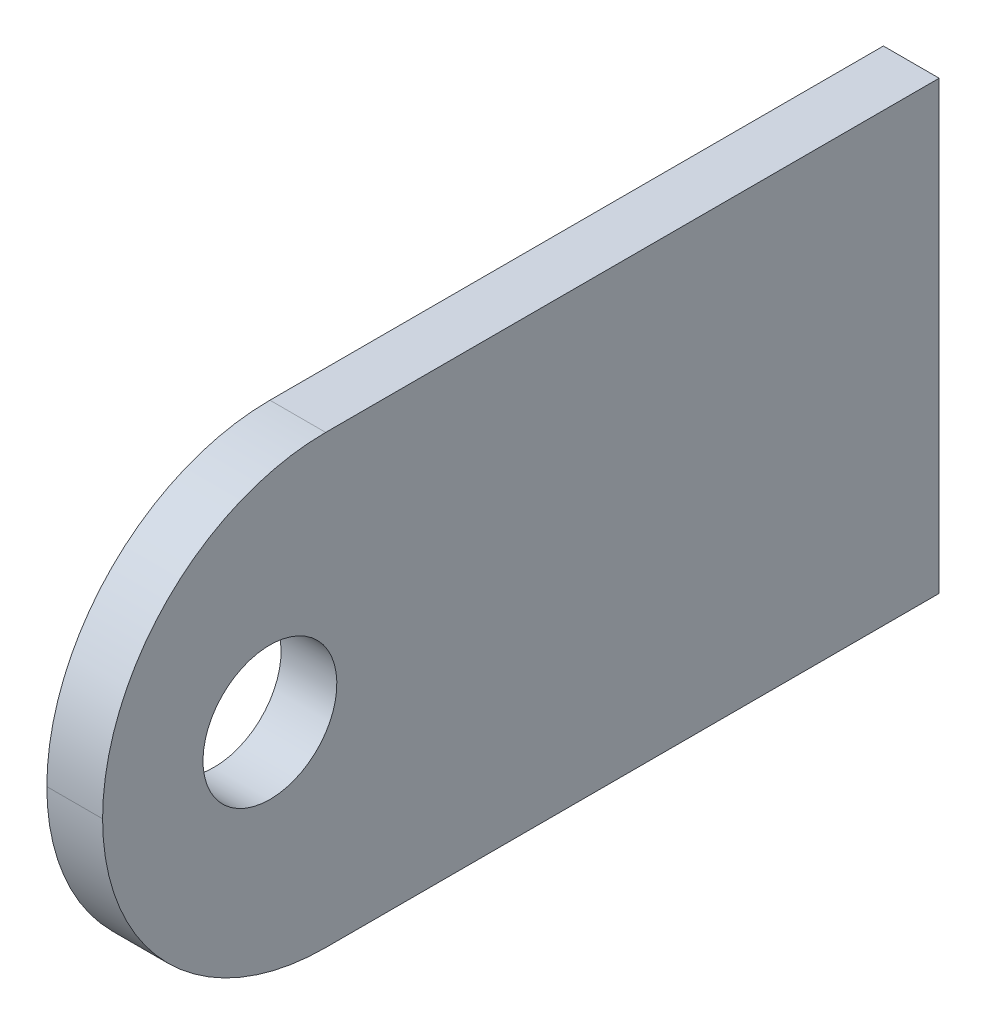
ISO-10303-21;
HEADER;
FILE_DESCRIPTION(('STEP AP214'),'2;1');
FILE_NAME('part.step','',(''),(''),'','','');
FILE_SCHEMA(('AUTOMOTIVE_DESIGN { 1 0 10303 214 1 1 1 1 }'));
ENDSEC;
DATA;
#1=APPLICATION_CONTEXT('core data for automotive mechanical design processes');
#2=APPLICATION_PROTOCOL_DEFINITION('international standard','automotive_design',2000,#1);
#3=PRODUCT_CONTEXT('',#1,'mechanical');
#4=PRODUCT('Part','Part','',(#3));
#5=PRODUCT_RELATED_PRODUCT_CATEGORY('part','',(#4));
#6=PRODUCT_DEFINITION_FORMATION('','',#4);
#7=PRODUCT_DEFINITION_CONTEXT('part definition',#1,'design');
#8=PRODUCT_DEFINITION('design','',#6,#7);
#9=PRODUCT_DEFINITION_SHAPE('','',#8);
#10=(LENGTH_UNIT() NAMED_UNIT(*) SI_UNIT(.MILLI.,.METRE.));
#11=(NAMED_UNIT(*) PLANE_ANGLE_UNIT() SI_UNIT($,.RADIAN.));
#12=(NAMED_UNIT(*) SI_UNIT($,.STERADIAN.) SOLID_ANGLE_UNIT());
#13=UNCERTAINTY_MEASURE_WITH_UNIT(LENGTH_MEASURE(1.E-05),#10,'distance_accuracy_value','');
#14=(GEOMETRIC_REPRESENTATION_CONTEXT(3) GLOBAL_UNCERTAINTY_ASSIGNED_CONTEXT((#13)) GLOBAL_UNIT_ASSIGNED_CONTEXT((#10,
#11,#12)) REPRESENTATION_CONTEXT('',''));
#15=CARTESIAN_POINT('',(0.,0.,0.));
#16=DIRECTION('',(0.,0.,1.));
#17=DIRECTION('',(1.,0.,0.));
#18=AXIS2_PLACEMENT_3D('',#15,#16,#17);
#19=CARTESIAN_POINT('',(-160.,0.,75.));
#20=DIRECTION('',(0.,-1.,0.));
#21=DIRECTION('',(1.,0.,0.));
#22=AXIS2_PLACEMENT_3D('',#19,#20,#21);
#23=PLANE('',#22);
#24=DIRECTION('',(0.,0.,-1.));
#25=VECTOR('',#24,1.);
#26=CARTESIAN_POINT('',(-160.,0.,75.));
#27=LINE('',#26,#25);
#28=CARTESIAN_POINT('',(-160.,0.,55.));
#29=VERTEX_POINT('',#28);
#30=CARTESIAN_POINT('',(-160.,0.,0.));
#31=VERTEX_POINT('',#30);
#32=EDGE_CURVE('E78',#29,#31,#27,.T.);
#33=ORIENTED_EDGE('',*,*,#32,.F.);
#34=DIRECTION('',(-1.,0.,0.));
#35=VECTOR('',#34,1.);
#36=CARTESIAN_POINT('',(-160.,0.,55.));
#37=LINE('',#36,#35);
#38=CARTESIAN_POINT('',(-155.,0.,55.));
#39=VERTEX_POINT('',#38);
#40=EDGE_CURVE('E119',#29,#39,#37,.F.);
#41=ORIENTED_EDGE('',*,*,#40,.T.);
#42=DIRECTION('',(0.,0.,-1.));
#43=VECTOR('',#42,1.);
#44=CARTESIAN_POINT('',(-155.,0.,75.));
#45=LINE('',#44,#43);
#46=CARTESIAN_POINT('',(-155.,0.,0.));
#47=VERTEX_POINT('',#46);
#48=EDGE_CURVE('E101',#39,#47,#45,.T.);
#49=ORIENTED_EDGE('',*,*,#48,.T.);
#50=DIRECTION('',(-1.,0.,0.));
#51=VECTOR('',#50,1.);
#52=CARTESIAN_POINT('',(-160.,0.,0.));
#53=LINE('',#52,#51);
#54=EDGE_CURVE('E97',#47,#31,#53,.T.);
#55=ORIENTED_EDGE('',*,*,#54,.T.);
#56=EDGE_LOOP('',(#33,#41,#49,#55));
#57=FACE_BOUND('',#56,.T.);
#58=ADVANCED_FACE('F34',(#57),#23,.F.);
#59=CARTESIAN_POINT('',(-160.,0.,75.));
#60=DIRECTION('',(1.,0.,0.));
#61=DIRECTION('',(0.,1.,0.));
#62=AXIS2_PLACEMENT_3D('',#59,#60,#61);
#63=PLANE('',#62);
#64=CARTESIAN_POINT('',(-160.,-20.,60.));
#65=DIRECTION('',(-1.,0.,0.));
#66=DIRECTION('',(0.,-1.,0.));
#67=AXIS2_PLACEMENT_3D('',#64,#65,#66);
#68=CIRCLE('',#67,6.);
#69=CARTESIAN_POINT('',(-160.,-26.,60.));
#70=VERTEX_POINT('',#69);
#71=EDGE_CURVE('E106',#70,#70,#68,.T.);
#72=ORIENTED_EDGE('',*,*,#71,.F.);
#73=EDGE_LOOP('',(#72));
#74=FACE_BOUND('',#73,.T.);
#75=CARTESIAN_POINT('',(-160.,-20.,55.));
#76=DIRECTION('',(1.,0.,0.));
#77=DIRECTION('',(0.,1.,0.));
#78=AXIS2_PLACEMENT_3D('',#75,#76,#77);
#79=CIRCLE('',#78,20.);
#80=CARTESIAN_POINT('',(-160.,-40.,55.));
#81=VERTEX_POINT('',#80);
#82=CARTESIAN_POINT('',(-160.,-20.,75.));
#83=VERTEX_POINT('',#82);
#84=EDGE_CURVE('E90',#81,#83,#79,.F.);
#85=ORIENTED_EDGE('',*,*,#84,.T.);
#86=CARTESIAN_POINT('',(-160.,-20.,55.));
#87=DIRECTION('',(1.,0.,0.));
#88=DIRECTION('',(0.,1.,0.));
#89=AXIS2_PLACEMENT_3D('',#86,#87,#88);
#90=CIRCLE('',#89,20.);
#91=EDGE_CURVE('E85',#83,#29,#90,.F.);
#92=ORIENTED_EDGE('',*,*,#91,.T.);
#93=ORIENTED_EDGE('',*,*,#32,.T.);
#94=DIRECTION('',(0.,-1.,0.));
#95=VECTOR('',#94,1.);
#96=CARTESIAN_POINT('',(-160.,0.,0.));
#97=LINE('',#96,#95);
#98=CARTESIAN_POINT('',(-160.,-40.,0.));
#99=VERTEX_POINT('',#98);
#100=EDGE_CURVE('E82',#31,#99,#97,.T.);
#101=ORIENTED_EDGE('',*,*,#100,.T.);
#102=DIRECTION('',(0.,0.,-1.));
#103=VECTOR('',#102,1.);
#104=CARTESIAN_POINT('',(-160.,-40.,75.));
#105=LINE('',#104,#103);
#106=EDGE_CURVE('E91',#81,#99,#105,.T.);
#107=ORIENTED_EDGE('',*,*,#106,.F.);
#108=EDGE_LOOP('',(#85,#92,#93,#101,#107));
#109=FACE_BOUND('',#108,.T.);
#110=ADVANCED_FACE('F80',(#74,#109),#63,.F.);
#111=CARTESIAN_POINT('',(-155.,-40.,75.));
#112=DIRECTION('',(0.,1.,0.));
#113=DIRECTION('',(-1.,0.,0.));
#114=AXIS2_PLACEMENT_3D('',#111,#112,#113);
#115=PLANE('',#114);
#116=DIRECTION('',(0.,0.,-1.));
#117=VECTOR('',#116,1.);
#118=CARTESIAN_POINT('',(-155.,-40.,75.));
#119=LINE('',#118,#117);
#120=CARTESIAN_POINT('',(-155.,-40.,55.));
#121=VERTEX_POINT('',#120);
#122=CARTESIAN_POINT('',(-155.,-40.,0.));
#123=VERTEX_POINT('',#122);
#124=EDGE_CURVE('E114',#121,#123,#119,.T.);
#125=ORIENTED_EDGE('',*,*,#124,.F.);
#126=DIRECTION('',(1.,0.,0.));
#127=VECTOR('',#126,1.);
#128=CARTESIAN_POINT('',(-155.,-40.,55.));
#129=LINE('',#128,#127);
#130=EDGE_CURVE('E11',#121,#81,#129,.F.);
#131=ORIENTED_EDGE('',*,*,#130,.T.);
#132=ORIENTED_EDGE('',*,*,#106,.T.);
#133=DIRECTION('',(1.,0.,0.));
#134=VECTOR('',#133,1.);
#135=CARTESIAN_POINT('',(-155.,-40.,0.));
#136=LINE('',#135,#134);
#137=EDGE_CURVE('E99',#99,#123,#136,.T.);
#138=ORIENTED_EDGE('',*,*,#137,.T.);
#139=EDGE_LOOP('',(#125,#131,#132,#138));
#140=FACE_BOUND('',#139,.T.);
#141=ADVANCED_FACE('F126',(#140),#115,.F.);
#142=CARTESIAN_POINT('',(-155.,0.,75.));
#143=DIRECTION('',(-1.,0.,0.));
#144=DIRECTION('',(0.,-1.,0.));
#145=AXIS2_PLACEMENT_3D('',#142,#143,#144);
#146=PLANE('',#145);
#147=CARTESIAN_POINT('',(-155.,-20.,60.));
#148=DIRECTION('',(-1.,0.,0.));
#149=DIRECTION('',(0.,-1.,0.));
#150=AXIS2_PLACEMENT_3D('',#147,#148,#149);
#151=CIRCLE('',#150,6.);
#152=CARTESIAN_POINT('',(-155.,-26.,60.));
#153=VERTEX_POINT('',#152);
#154=EDGE_CURVE('E103',#153,#153,#151,.T.);
#155=ORIENTED_EDGE('',*,*,#154,.T.);
#156=EDGE_LOOP('',(#155));
#157=FACE_BOUND('',#156,.T.);
#158=ORIENTED_EDGE('',*,*,#48,.F.);
#159=CARTESIAN_POINT('',(-155.,-20.,55.));
#160=DIRECTION('',(-1.,0.,0.));
#161=DIRECTION('',(0.,-1.,0.));
#162=AXIS2_PLACEMENT_3D('',#159,#160,#161);
#163=CIRCLE('',#162,20.);
#164=CARTESIAN_POINT('',(-155.,-20.,75.));
#165=VERTEX_POINT('',#164);
#166=EDGE_CURVE('E43',#39,#165,#163,.F.);
#167=ORIENTED_EDGE('',*,*,#166,.T.);
#168=CARTESIAN_POINT('',(-155.,-20.,55.));
#169=DIRECTION('',(-1.,0.,0.));
#170=DIRECTION('',(0.,-1.,0.));
#171=AXIS2_PLACEMENT_3D('',#168,#169,#170);
#172=CIRCLE('',#171,20.);
#173=EDGE_CURVE('E50',#165,#121,#172,.F.);
#174=ORIENTED_EDGE('',*,*,#173,.T.);
#175=ORIENTED_EDGE('',*,*,#124,.T.);
#176=DIRECTION('',(0.,1.,0.));
#177=VECTOR('',#176,1.);
#178=CARTESIAN_POINT('',(-155.,0.,0.));
#179=LINE('',#178,#177);
#180=EDGE_CURVE('E111',#123,#47,#179,.T.);
#181=ORIENTED_EDGE('',*,*,#180,.T.);
#182=EDGE_LOOP('',(#158,#167,#174,#175,#181));
#183=FACE_BOUND('',#182,.T.);
#184=ADVANCED_FACE('F123',(#157,#183),#146,.F.);
#185=CARTESIAN_POINT('',(-2.5,0.,0.));
#186=DIRECTION('',(0.,0.,-1.));
#187=DIRECTION('',(-1.,0.,0.));
#188=AXIS2_PLACEMENT_3D('',#185,#186,#187);
#189=PLANE('',#188);
#190=ORIENTED_EDGE('',*,*,#54,.F.);
#191=ORIENTED_EDGE('',*,*,#180,.F.);
#192=ORIENTED_EDGE('',*,*,#137,.F.);
#193=ORIENTED_EDGE('',*,*,#100,.F.);
#194=EDGE_LOOP('',(#190,#191,#192,#193));
#195=FACE_BOUND('',#194,.T.);
#196=ADVANCED_FACE('F95',(#195),#189,.T.);
#197=CARTESIAN_POINT('',(-150.,-20.,60.));
#198=DIRECTION('',(-1.,0.,0.));
#199=DIRECTION('',(0.,-1.,0.));
#200=AXIS2_PLACEMENT_3D('',#197,#198,#199);
#201=CYLINDRICAL_SURFACE('',#200,6.);
#202=ORIENTED_EDGE('',*,*,#71,.T.);
#203=EDGE_LOOP('',(#202));
#204=FACE_BOUND('',#203,.T.);
#205=ORIENTED_EDGE('',*,*,#154,.F.);
#206=EDGE_LOOP('',(#205));
#207=FACE_BOUND('',#206,.T.);
#208=ADVANCED_FACE('F136',(#204,#207),#201,.F.);
#209=CARTESIAN_POINT('',(-2.49999999999995,-19.9999999999996,55.));
#210=DIRECTION('',(1.,0.,0.));
#211=DIRECTION('',(0.,1.,0.));
#212=AXIS2_PLACEMENT_3D('',#209,#210,#211);
#213=CYLINDRICAL_SURFACE('',#212,20.);
#214=ORIENTED_EDGE('',*,*,#130,.F.);
#215=ORIENTED_EDGE('',*,*,#173,.F.);
#216=DIRECTION('',(1.,0.,0.));
#217=VECTOR('',#216,1.);
#218=CARTESIAN_POINT('',(-2.49999999999995,-19.9999999999996,75.));
#219=LINE('',#218,#217);
#220=EDGE_CURVE('E38',#83,#165,#219,.T.);
#221=ORIENTED_EDGE('',*,*,#220,.F.);
#222=ORIENTED_EDGE('',*,*,#84,.F.);
#223=EDGE_LOOP('',(#214,#215,#221,#222));
#224=FACE_BOUND('',#223,.T.);
#225=ADVANCED_FACE('F36',(#224),#213,.T.);
#226=CARTESIAN_POINT('',(-2.49999999999992,-19.9999999999994,55.));
#227=DIRECTION('',(-1.,0.,0.));
#228=DIRECTION('',(0.,-1.,0.));
#229=AXIS2_PLACEMENT_3D('',#226,#227,#228);
#230=CYLINDRICAL_SURFACE('',#229,20.);
#231=ORIENTED_EDGE('',*,*,#166,.F.);
#232=ORIENTED_EDGE('',*,*,#40,.F.);
#233=ORIENTED_EDGE('',*,*,#91,.F.);
#234=ORIENTED_EDGE('',*,*,#220,.T.);
#235=EDGE_LOOP('',(#231,#232,#233,#234));
#236=FACE_BOUND('',#235,.T.);
#237=ADVANCED_FACE('F131',(#236),#230,.T.);
#238=CLOSED_SHELL('',(#58,#110,#141,#184,#196,#208,#225,#237));
#239=MANIFOLD_SOLID_BREP('B2',#238);
#240=ADVANCED_BREP_SHAPE_REPRESENTATION('',(#18,#239),#14);
#241=SHAPE_DEFINITION_REPRESENTATION(#9,#240);
ENDSEC;
END-ISO-10303-21;
